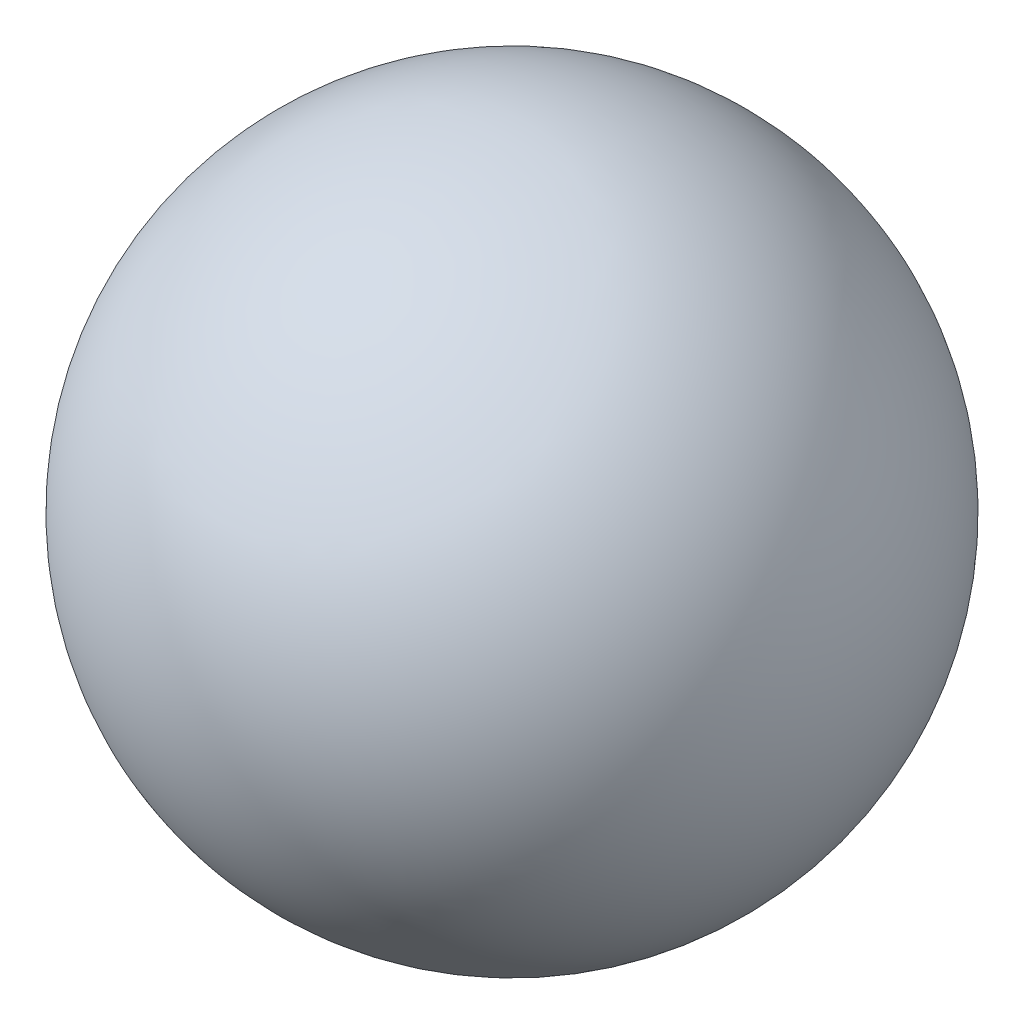
ISO-10303-21;
HEADER;
FILE_DESCRIPTION(('STEP AP214'),'2;1');
FILE_NAME('part.step','',(''),(''),'','','');
FILE_SCHEMA(('AUTOMOTIVE_DESIGN { 1 0 10303 214 1 1 1 1 }'));
ENDSEC;
DATA;
#1=APPLICATION_CONTEXT('core data for automotive mechanical design processes');
#2=APPLICATION_PROTOCOL_DEFINITION('international standard','automotive_design',2000,#1);
#3=PRODUCT_CONTEXT('',#1,'mechanical');
#4=PRODUCT('Part','Part','',(#3));
#5=PRODUCT_RELATED_PRODUCT_CATEGORY('part','',(#4));
#6=PRODUCT_DEFINITION_FORMATION('','',#4);
#7=PRODUCT_DEFINITION_CONTEXT('part definition',#1,'design');
#8=PRODUCT_DEFINITION('design','',#6,#7);
#9=PRODUCT_DEFINITION_SHAPE('','',#8);
#10=(LENGTH_UNIT() NAMED_UNIT(*) SI_UNIT(.MILLI.,.METRE.));
#11=(NAMED_UNIT(*) PLANE_ANGLE_UNIT() SI_UNIT($,.RADIAN.));
#12=(NAMED_UNIT(*) SI_UNIT($,.STERADIAN.) SOLID_ANGLE_UNIT());
#13=UNCERTAINTY_MEASURE_WITH_UNIT(LENGTH_MEASURE(1.E-05),#10,'distance_accuracy_value','');
#14=(GEOMETRIC_REPRESENTATION_CONTEXT(3) GLOBAL_UNCERTAINTY_ASSIGNED_CONTEXT((#13)) GLOBAL_UNIT_ASSIGNED_CONTEXT((#10,
#11,#12)) REPRESENTATION_CONTEXT('',''));
#15=CARTESIAN_POINT('',(0.,0.,0.));
#16=DIRECTION('',(0.,0.,1.));
#17=DIRECTION('',(1.,0.,0.));
#18=AXIS2_PLACEMENT_3D('',#15,#16,#17);
#19=CARTESIAN_POINT('',(57.535,17.1174129128277,-59.1026198016785));
#20=DIRECTION('',(0.,0.27818943001272,-0.960526231307192));
#21=DIRECTION('',(0.173648177666934,0.94593367956292,0.273963107482574));
#22=AXIS2_PLACEMENT_3D('',#19,#20,#21);
#23=SPHERICAL_SURFACE('',#22,6.75);
#24=CARTESIAN_POINT('',(57.535,15.2396342602418,-52.619067740355));
#25=VERTEX_POINT('',#24);
#26=VERTEX_LOOP('',#25);
#27=FACE_BOUND('',#26,.T.);
#28=CARTESIAN_POINT('',(57.535,18.9951915654136,-65.5861718630021));
#29=VERTEX_POINT('',#28);
#30=VERTEX_LOOP('',#29);
#31=FACE_BOUND('',#30,.T.);
#32=ADVANCED_FACE('F16',(#27,#31),#23,.T.);
#33=CLOSED_SHELL('',(#32));
#34=MANIFOLD_SOLID_BREP('B1',#33);
#35=ADVANCED_BREP_SHAPE_REPRESENTATION('',(#18,#34),#14);
#36=SHAPE_DEFINITION_REPRESENTATION(#9,#35);
ENDSEC;
END-ISO-10303-21;
